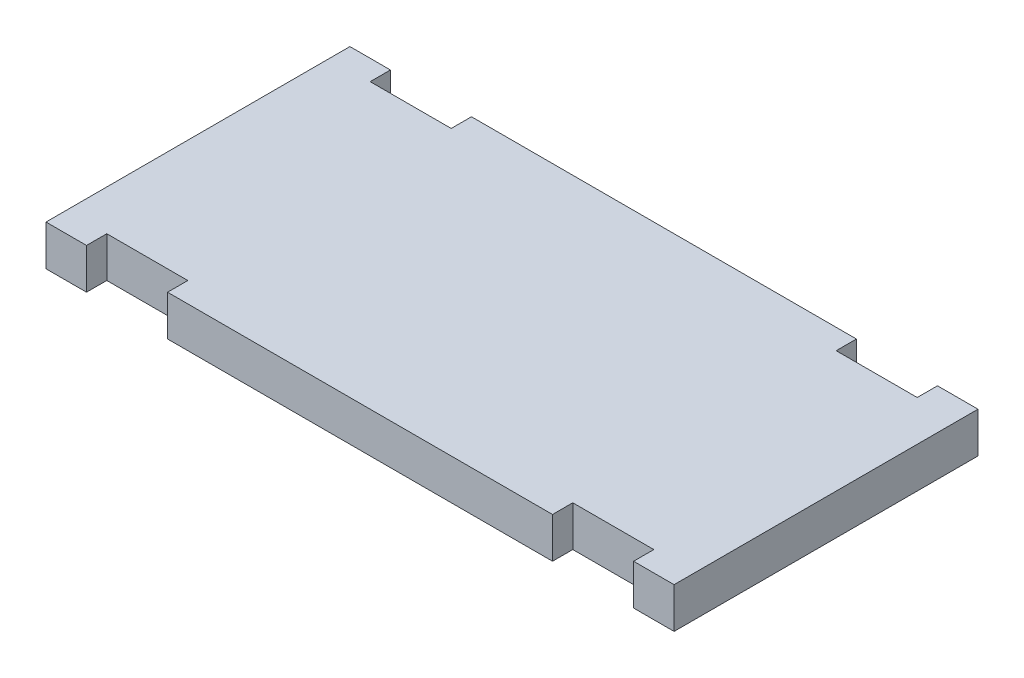
ISO-10303-21;
HEADER;
FILE_DESCRIPTION(('STEP AP214'),'2;1');
FILE_NAME('part.step','',(''),(''),'','','');
FILE_SCHEMA(('AUTOMOTIVE_DESIGN { 1 0 10303 214 1 1 1 1 }'));
ENDSEC;
DATA;
#1=APPLICATION_CONTEXT('core data for automotive mechanical design processes');
#2=APPLICATION_PROTOCOL_DEFINITION('international standard','automotive_design',2000,#1);
#3=PRODUCT_CONTEXT('',#1,'mechanical');
#4=PRODUCT('Part','Part','',(#3));
#5=PRODUCT_RELATED_PRODUCT_CATEGORY('part','',(#4));
#6=PRODUCT_DEFINITION_FORMATION('','',#4);
#7=PRODUCT_DEFINITION_CONTEXT('part definition',#1,'design');
#8=PRODUCT_DEFINITION('design','',#6,#7);
#9=PRODUCT_DEFINITION_SHAPE('','',#8);
#10=(LENGTH_UNIT() NAMED_UNIT(*) SI_UNIT(.MILLI.,.METRE.));
#11=(NAMED_UNIT(*) PLANE_ANGLE_UNIT() SI_UNIT($,.RADIAN.));
#12=(NAMED_UNIT(*) SI_UNIT($,.STERADIAN.) SOLID_ANGLE_UNIT());
#13=UNCERTAINTY_MEASURE_WITH_UNIT(LENGTH_MEASURE(1.E-05),#10,'distance_accuracy_value','');
#14=(GEOMETRIC_REPRESENTATION_CONTEXT(3) GLOBAL_UNCERTAINTY_ASSIGNED_CONTEXT((#13)) GLOBAL_UNIT_ASSIGNED_CONTEXT((#10,
#11,#12)) REPRESENTATION_CONTEXT('',''));
#15=CARTESIAN_POINT('',(0.,0.,0.));
#16=DIRECTION('',(0.,0.,1.));
#17=DIRECTION('',(1.,0.,0.));
#18=AXIS2_PLACEMENT_3D('',#15,#16,#17);
#19=CARTESIAN_POINT('',(-7.75,1.,-3.75));
#20=DIRECTION('',(1.,0.,0.));
#21=DIRECTION('',(0.,0.,-1.));
#22=AXIS2_PLACEMENT_3D('',#19,#20,#21);
#23=PLANE('',#22);
#24=DIRECTION('',(0.,0.,1.));
#25=VECTOR('',#24,1.);
#26=CARTESIAN_POINT('',(-7.75,0.,-3.75));
#27=LINE('',#26,#25);
#28=CARTESIAN_POINT('',(-7.75,0.,-3.75));
#29=VERTEX_POINT('',#28);
#30=CARTESIAN_POINT('',(-7.75,0.,3.75));
#31=VERTEX_POINT('',#30);
#32=EDGE_CURVE('E201',#29,#31,#27,.T.);
#33=ORIENTED_EDGE('',*,*,#32,.T.);
#34=DIRECTION('',(0.,-1.,0.));
#35=VECTOR('',#34,1.);
#36=CARTESIAN_POINT('',(-7.75,1.,3.75));
#37=LINE('',#36,#35);
#38=CARTESIAN_POINT('',(-7.75,1.,3.75));
#39=VERTEX_POINT('',#38);
#40=EDGE_CURVE('E11',#39,#31,#37,.T.);
#41=ORIENTED_EDGE('',*,*,#40,.F.);
#42=DIRECTION('',(0.,0.,1.));
#43=VECTOR('',#42,1.);
#44=CARTESIAN_POINT('',(-7.75,1.,-3.75));
#45=LINE('',#44,#43);
#46=CARTESIAN_POINT('',(-7.75,1.,-3.75));
#47=VERTEX_POINT('',#46);
#48=EDGE_CURVE('E239',#47,#39,#45,.T.);
#49=ORIENTED_EDGE('',*,*,#48,.F.);
#50=DIRECTION('',(0.,-1.,0.));
#51=VECTOR('',#50,1.);
#52=CARTESIAN_POINT('',(-7.75,1.,-3.75));
#53=LINE('',#52,#51);
#54=EDGE_CURVE('E197',#47,#29,#53,.T.);
#55=ORIENTED_EDGE('',*,*,#54,.T.);
#56=EDGE_LOOP('',(#33,#41,#49,#55));
#57=FACE_BOUND('',#56,.T.);
#58=ADVANCED_FACE('F33',(#57),#23,.F.);
#59=CARTESIAN_POINT('',(-7.75,1.,3.75));
#60=DIRECTION('',(0.,0.,-1.));
#61=DIRECTION('',(-1.,0.,0.));
#62=AXIS2_PLACEMENT_3D('',#59,#60,#61);
#63=PLANE('',#62);
#64=DIRECTION('',(1.,0.,0.));
#65=VECTOR('',#64,1.);
#66=CARTESIAN_POINT('',(-7.75,0.,3.75));
#67=LINE('',#66,#65);
#68=CARTESIAN_POINT('',(-6.75,0.,3.75));
#69=VERTEX_POINT('',#68);
#70=EDGE_CURVE('E204',#31,#69,#67,.T.);
#71=ORIENTED_EDGE('',*,*,#70,.T.);
#72=DIRECTION('',(0.,-1.,0.));
#73=VECTOR('',#72,1.);
#74=CARTESIAN_POINT('',(-6.75,1.,3.75));
#75=LINE('',#74,#73);
#76=CARTESIAN_POINT('',(-6.75,1.,3.75));
#77=VERTEX_POINT('',#76);
#78=EDGE_CURVE('E41',#77,#69,#75,.T.);
#79=ORIENTED_EDGE('',*,*,#78,.F.);
#80=DIRECTION('',(1.,0.,0.));
#81=VECTOR('',#80,1.);
#82=CARTESIAN_POINT('',(-7.75,1.,3.75));
#83=LINE('',#82,#81);
#84=EDGE_CURVE('E128',#39,#77,#83,.T.);
#85=ORIENTED_EDGE('',*,*,#84,.F.);
#86=ORIENTED_EDGE('',*,*,#40,.T.);
#87=EDGE_LOOP('',(#71,#79,#85,#86));
#88=FACE_BOUND('',#87,.T.);
#89=ADVANCED_FACE('F357',(#88),#63,.F.);
#90=CARTESIAN_POINT('',(-6.75,1.,3.75));
#91=DIRECTION('',(-1.,0.,0.));
#92=DIRECTION('',(0.,0.,1.));
#93=AXIS2_PLACEMENT_3D('',#90,#91,#92);
#94=PLANE('',#93);
#95=DIRECTION('',(0.,0.,-1.));
#96=VECTOR('',#95,1.);
#97=CARTESIAN_POINT('',(-6.75,0.,3.75));
#98=LINE('',#97,#96);
#99=CARTESIAN_POINT('',(-6.75,0.,3.25));
#100=VERTEX_POINT('',#99);
#101=EDGE_CURVE('E206',#69,#100,#98,.T.);
#102=ORIENTED_EDGE('',*,*,#101,.T.);
#103=DIRECTION('',(0.,-1.,0.));
#104=VECTOR('',#103,1.);
#105=CARTESIAN_POINT('',(-6.75,1.,3.25));
#106=LINE('',#105,#104);
#107=CARTESIAN_POINT('',(-6.75,1.,3.25));
#108=VERTEX_POINT('',#107);
#109=EDGE_CURVE('E282',#108,#100,#106,.T.);
#110=ORIENTED_EDGE('',*,*,#109,.F.);
#111=DIRECTION('',(0.,0.,-1.));
#112=VECTOR('',#111,1.);
#113=CARTESIAN_POINT('',(-6.75,1.,3.75));
#114=LINE('',#113,#112);
#115=EDGE_CURVE('E290',#77,#108,#114,.T.);
#116=ORIENTED_EDGE('',*,*,#115,.F.);
#117=ORIENTED_EDGE('',*,*,#78,.T.);
#118=EDGE_LOOP('',(#102,#110,#116,#117));
#119=FACE_BOUND('',#118,.T.);
#120=ADVANCED_FACE('F288',(#119),#94,.F.);
#121=CARTESIAN_POINT('',(-6.75,1.,3.25));
#122=DIRECTION('',(0.,0.,-1.));
#123=DIRECTION('',(-1.,0.,0.));
#124=AXIS2_PLACEMENT_3D('',#121,#122,#123);
#125=PLANE('',#124);
#126=DIRECTION('',(1.,0.,0.));
#127=VECTOR('',#126,1.);
#128=CARTESIAN_POINT('',(-6.75,0.,3.25));
#129=LINE('',#128,#127);
#130=CARTESIAN_POINT('',(-4.75,0.,3.25));
#131=VERTEX_POINT('',#130);
#132=EDGE_CURVE('E208',#100,#131,#129,.T.);
#133=ORIENTED_EDGE('',*,*,#132,.T.);
#134=DIRECTION('',(0.,-1.,0.));
#135=VECTOR('',#134,1.);
#136=CARTESIAN_POINT('',(-4.75,1.,3.25));
#137=LINE('',#136,#135);
#138=CARTESIAN_POINT('',(-4.75,1.,3.25));
#139=VERTEX_POINT('',#138);
#140=EDGE_CURVE('E279',#139,#131,#137,.T.);
#141=ORIENTED_EDGE('',*,*,#140,.F.);
#142=DIRECTION('',(1.,0.,0.));
#143=VECTOR('',#142,1.);
#144=CARTESIAN_POINT('',(-6.75,1.,3.25));
#145=LINE('',#144,#143);
#146=EDGE_CURVE('E308',#108,#139,#145,.T.);
#147=ORIENTED_EDGE('',*,*,#146,.F.);
#148=ORIENTED_EDGE('',*,*,#109,.T.);
#149=EDGE_LOOP('',(#133,#141,#147,#148));
#150=FACE_BOUND('',#149,.T.);
#151=ADVANCED_FACE('F299',(#150),#125,.F.);
#152=CARTESIAN_POINT('',(-4.75,1.,3.75));
#153=DIRECTION('',(1.,0.,0.));
#154=DIRECTION('',(0.,0.,-1.));
#155=AXIS2_PLACEMENT_3D('',#152,#153,#154);
#156=PLANE('',#155);
#157=DIRECTION('',(0.,0.,1.));
#158=VECTOR('',#157,1.);
#159=CARTESIAN_POINT('',(-4.75,0.,3.75));
#160=LINE('',#159,#158);
#161=CARTESIAN_POINT('',(-4.75,0.,3.75));
#162=VERTEX_POINT('',#161);
#163=EDGE_CURVE('E210',#131,#162,#160,.T.);
#164=ORIENTED_EDGE('',*,*,#163,.T.);
#165=DIRECTION('',(0.,-1.,0.));
#166=VECTOR('',#165,1.);
#167=CARTESIAN_POINT('',(-4.75,1.,3.75));
#168=LINE('',#167,#166);
#169=CARTESIAN_POINT('',(-4.75,1.,3.75));
#170=VERTEX_POINT('',#169);
#171=EDGE_CURVE('E276',#170,#162,#168,.T.);
#172=ORIENTED_EDGE('',*,*,#171,.F.);
#173=DIRECTION('',(0.,0.,1.));
#174=VECTOR('',#173,1.);
#175=CARTESIAN_POINT('',(-4.75,1.,3.75));
#176=LINE('',#175,#174);
#177=EDGE_CURVE('E305',#139,#170,#176,.T.);
#178=ORIENTED_EDGE('',*,*,#177,.F.);
#179=ORIENTED_EDGE('',*,*,#140,.T.);
#180=EDGE_LOOP('',(#164,#172,#178,#179));
#181=FACE_BOUND('',#180,.T.);
#182=ADVANCED_FACE('F303',(#181),#156,.F.);
#183=CARTESIAN_POINT('',(-4.75,1.,3.75));
#184=DIRECTION('',(0.,0.,-1.));
#185=DIRECTION('',(-1.,0.,0.));
#186=AXIS2_PLACEMENT_3D('',#183,#184,#185);
#187=PLANE('',#186);
#188=DIRECTION('',(1.,0.,0.));
#189=VECTOR('',#188,1.);
#190=CARTESIAN_POINT('',(-4.75,0.,3.75));
#191=LINE('',#190,#189);
#192=CARTESIAN_POINT('',(4.75,0.,3.75));
#193=VERTEX_POINT('',#192);
#194=EDGE_CURVE('E212',#162,#193,#191,.T.);
#195=ORIENTED_EDGE('',*,*,#194,.T.);
#196=DIRECTION('',(0.,-1.,0.));
#197=VECTOR('',#196,1.);
#198=CARTESIAN_POINT('',(4.75,1.,3.75));
#199=LINE('',#198,#197);
#200=CARTESIAN_POINT('',(4.75,1.,3.75));
#201=VERTEX_POINT('',#200);
#202=EDGE_CURVE('E273',#201,#193,#199,.T.);
#203=ORIENTED_EDGE('',*,*,#202,.F.);
#204=DIRECTION('',(1.,0.,0.));
#205=VECTOR('',#204,1.);
#206=CARTESIAN_POINT('',(-4.75,1.,3.75));
#207=LINE('',#206,#205);
#208=EDGE_CURVE('E307',#170,#201,#207,.T.);
#209=ORIENTED_EDGE('',*,*,#208,.F.);
#210=ORIENTED_EDGE('',*,*,#171,.T.);
#211=EDGE_LOOP('',(#195,#203,#209,#210));
#212=FACE_BOUND('',#211,.T.);
#213=ADVANCED_FACE('F370',(#212),#187,.F.);
#214=CARTESIAN_POINT('',(4.75,1.,3.75));
#215=DIRECTION('',(-1.,0.,0.));
#216=DIRECTION('',(0.,0.,1.));
#217=AXIS2_PLACEMENT_3D('',#214,#215,#216);
#218=PLANE('',#217);
#219=DIRECTION('',(0.,0.,-1.));
#220=VECTOR('',#219,1.);
#221=CARTESIAN_POINT('',(4.75,0.,3.75));
#222=LINE('',#221,#220);
#223=CARTESIAN_POINT('',(4.75,0.,3.25));
#224=VERTEX_POINT('',#223);
#225=EDGE_CURVE('E214',#193,#224,#222,.T.);
#226=ORIENTED_EDGE('',*,*,#225,.T.);
#227=DIRECTION('',(0.,-1.,0.));
#228=VECTOR('',#227,1.);
#229=CARTESIAN_POINT('',(4.75,1.,3.25));
#230=LINE('',#229,#228);
#231=CARTESIAN_POINT('',(4.75,1.,3.25));
#232=VERTEX_POINT('',#231);
#233=EDGE_CURVE('E270',#232,#224,#230,.T.);
#234=ORIENTED_EDGE('',*,*,#233,.F.);
#235=DIRECTION('',(0.,0.,-1.));
#236=VECTOR('',#235,1.);
#237=CARTESIAN_POINT('',(4.75,1.,3.75));
#238=LINE('',#237,#236);
#239=EDGE_CURVE('E310',#201,#232,#238,.T.);
#240=ORIENTED_EDGE('',*,*,#239,.F.);
#241=ORIENTED_EDGE('',*,*,#202,.T.);
#242=EDGE_LOOP('',(#226,#234,#240,#241));
#243=FACE_BOUND('',#242,.T.);
#244=ADVANCED_FACE('F373',(#243),#218,.F.);
#245=CARTESIAN_POINT('',(6.75,1.,3.25));
#246=DIRECTION('',(0.,0.,-1.));
#247=DIRECTION('',(-1.,0.,0.));
#248=AXIS2_PLACEMENT_3D('',#245,#246,#247);
#249=PLANE('',#248);
#250=DIRECTION('',(1.,0.,0.));
#251=VECTOR('',#250,1.);
#252=CARTESIAN_POINT('',(6.75,0.,3.25));
#253=LINE('',#252,#251);
#254=CARTESIAN_POINT('',(6.75,0.,3.25));
#255=VERTEX_POINT('',#254);
#256=EDGE_CURVE('E216',#224,#255,#253,.T.);
#257=ORIENTED_EDGE('',*,*,#256,.T.);
#258=DIRECTION('',(0.,-1.,0.));
#259=VECTOR('',#258,1.);
#260=CARTESIAN_POINT('',(6.75,1.,3.25));
#261=LINE('',#260,#259);
#262=CARTESIAN_POINT('',(6.75,1.,3.25));
#263=VERTEX_POINT('',#262);
#264=EDGE_CURVE('E267',#263,#255,#261,.T.);
#265=ORIENTED_EDGE('',*,*,#264,.F.);
#266=DIRECTION('',(1.,0.,0.));
#267=VECTOR('',#266,1.);
#268=CARTESIAN_POINT('',(6.75,1.,3.25));
#269=LINE('',#268,#267);
#270=EDGE_CURVE('E316',#232,#263,#269,.T.);
#271=ORIENTED_EDGE('',*,*,#270,.F.);
#272=ORIENTED_EDGE('',*,*,#233,.T.);
#273=EDGE_LOOP('',(#257,#265,#271,#272));
#274=FACE_BOUND('',#273,.T.);
#275=ADVANCED_FACE('F377',(#274),#249,.F.);
#276=CARTESIAN_POINT('',(6.75,1.,3.75));
#277=DIRECTION('',(1.,0.,0.));
#278=DIRECTION('',(0.,0.,-1.));
#279=AXIS2_PLACEMENT_3D('',#276,#277,#278);
#280=PLANE('',#279);
#281=DIRECTION('',(0.,0.,1.));
#282=VECTOR('',#281,1.);
#283=CARTESIAN_POINT('',(6.75,0.,3.75));
#284=LINE('',#283,#282);
#285=CARTESIAN_POINT('',(6.75,0.,3.75));
#286=VERTEX_POINT('',#285);
#287=EDGE_CURVE('E218',#255,#286,#284,.T.);
#288=ORIENTED_EDGE('',*,*,#287,.T.);
#289=DIRECTION('',(0.,-1.,0.));
#290=VECTOR('',#289,1.);
#291=CARTESIAN_POINT('',(6.75,1.,3.75));
#292=LINE('',#291,#290);
#293=CARTESIAN_POINT('',(6.75,1.,3.75));
#294=VERTEX_POINT('',#293);
#295=EDGE_CURVE('E264',#294,#286,#292,.T.);
#296=ORIENTED_EDGE('',*,*,#295,.F.);
#297=DIRECTION('',(0.,0.,1.));
#298=VECTOR('',#297,1.);
#299=CARTESIAN_POINT('',(6.75,1.,3.75));
#300=LINE('',#299,#298);
#301=EDGE_CURVE('E318',#263,#294,#300,.T.);
#302=ORIENTED_EDGE('',*,*,#301,.F.);
#303=ORIENTED_EDGE('',*,*,#264,.T.);
#304=EDGE_LOOP('',(#288,#296,#302,#303));
#305=FACE_BOUND('',#304,.T.);
#306=ADVANCED_FACE('F381',(#305),#280,.F.);
#307=CARTESIAN_POINT('',(6.75,1.,3.75));
#308=DIRECTION('',(0.,0.,-1.));
#309=DIRECTION('',(-1.,0.,0.));
#310=AXIS2_PLACEMENT_3D('',#307,#308,#309);
#311=PLANE('',#310);
#312=DIRECTION('',(1.,0.,0.));
#313=VECTOR('',#312,1.);
#314=CARTESIAN_POINT('',(6.75,0.,3.75));
#315=LINE('',#314,#313);
#316=CARTESIAN_POINT('',(7.75,0.,3.75));
#317=VERTEX_POINT('',#316);
#318=EDGE_CURVE('E220',#286,#317,#315,.T.);
#319=ORIENTED_EDGE('',*,*,#318,.T.);
#320=DIRECTION('',(0.,-1.,0.));
#321=VECTOR('',#320,1.);
#322=CARTESIAN_POINT('',(7.75,1.,3.75));
#323=LINE('',#322,#321);
#324=CARTESIAN_POINT('',(7.75,1.,3.75));
#325=VERTEX_POINT('',#324);
#326=EDGE_CURVE('E261',#325,#317,#323,.T.);
#327=ORIENTED_EDGE('',*,*,#326,.F.);
#328=DIRECTION('',(1.,0.,0.));
#329=VECTOR('',#328,1.);
#330=CARTESIAN_POINT('',(6.75,1.,3.75));
#331=LINE('',#330,#329);
#332=EDGE_CURVE('E320',#294,#325,#331,.T.);
#333=ORIENTED_EDGE('',*,*,#332,.F.);
#334=ORIENTED_EDGE('',*,*,#295,.T.);
#335=EDGE_LOOP('',(#319,#327,#333,#334));
#336=FACE_BOUND('',#335,.T.);
#337=ADVANCED_FACE('F385',(#336),#311,.F.);
#338=CARTESIAN_POINT('',(7.75,1.,-3.75));
#339=DIRECTION('',(-1.,0.,0.));
#340=DIRECTION('',(0.,0.,1.));
#341=AXIS2_PLACEMENT_3D('',#338,#339,#340);
#342=PLANE('',#341);
#343=DIRECTION('',(0.,0.,-1.));
#344=VECTOR('',#343,1.);
#345=CARTESIAN_POINT('',(7.75,0.,-3.75));
#346=LINE('',#345,#344);
#347=CARTESIAN_POINT('',(7.75,0.,-3.75));
#348=VERTEX_POINT('',#347);
#349=EDGE_CURVE('E222',#317,#348,#346,.T.);
#350=ORIENTED_EDGE('',*,*,#349,.T.);
#351=DIRECTION('',(0.,-1.,0.));
#352=VECTOR('',#351,1.);
#353=CARTESIAN_POINT('',(7.75,1.,-3.75));
#354=LINE('',#353,#352);
#355=CARTESIAN_POINT('',(7.75,1.,-3.75));
#356=VERTEX_POINT('',#355);
#357=EDGE_CURVE('E258',#356,#348,#354,.T.);
#358=ORIENTED_EDGE('',*,*,#357,.F.);
#359=DIRECTION('',(0.,0.,-1.));
#360=VECTOR('',#359,1.);
#361=CARTESIAN_POINT('',(7.75,1.,-3.75));
#362=LINE('',#361,#360);
#363=EDGE_CURVE('E322',#325,#356,#362,.T.);
#364=ORIENTED_EDGE('',*,*,#363,.F.);
#365=ORIENTED_EDGE('',*,*,#326,.T.);
#366=EDGE_LOOP('',(#350,#358,#364,#365));
#367=FACE_BOUND('',#366,.T.);
#368=ADVANCED_FACE('F389',(#367),#342,.F.);
#369=CARTESIAN_POINT('',(6.75,1.,-3.75));
#370=DIRECTION('',(0.,0.,1.));
#371=DIRECTION('',(1.,0.,0.));
#372=AXIS2_PLACEMENT_3D('',#369,#370,#371);
#373=PLANE('',#372);
#374=DIRECTION('',(-1.,0.,0.));
#375=VECTOR('',#374,1.);
#376=CARTESIAN_POINT('',(6.75,0.,-3.75));
#377=LINE('',#376,#375);
#378=CARTESIAN_POINT('',(6.75,0.,-3.75));
#379=VERTEX_POINT('',#378);
#380=EDGE_CURVE('E224',#348,#379,#377,.T.);
#381=ORIENTED_EDGE('',*,*,#380,.T.);
#382=DIRECTION('',(0.,-1.,0.));
#383=VECTOR('',#382,1.);
#384=CARTESIAN_POINT('',(6.75,1.,-3.75));
#385=LINE('',#384,#383);
#386=CARTESIAN_POINT('',(6.75,1.,-3.75));
#387=VERTEX_POINT('',#386);
#388=EDGE_CURVE('E255',#387,#379,#385,.T.);
#389=ORIENTED_EDGE('',*,*,#388,.F.);
#390=DIRECTION('',(-1.,0.,0.));
#391=VECTOR('',#390,1.);
#392=CARTESIAN_POINT('',(6.75,1.,-3.75));
#393=LINE('',#392,#391);
#394=EDGE_CURVE('E324',#356,#387,#393,.T.);
#395=ORIENTED_EDGE('',*,*,#394,.F.);
#396=ORIENTED_EDGE('',*,*,#357,.T.);
#397=EDGE_LOOP('',(#381,#389,#395,#396));
#398=FACE_BOUND('',#397,.T.);
#399=ADVANCED_FACE('F393',(#398),#373,.F.);
#400=CARTESIAN_POINT('',(6.75,1.,-3.75));
#401=DIRECTION('',(1.,0.,0.));
#402=DIRECTION('',(0.,0.,-1.));
#403=AXIS2_PLACEMENT_3D('',#400,#401,#402);
#404=PLANE('',#403);
#405=DIRECTION('',(0.,0.,1.));
#406=VECTOR('',#405,1.);
#407=CARTESIAN_POINT('',(6.75,0.,-3.75));
#408=LINE('',#407,#406);
#409=CARTESIAN_POINT('',(6.75,0.,-3.25));
#410=VERTEX_POINT('',#409);
#411=EDGE_CURVE('E226',#379,#410,#408,.T.);
#412=ORIENTED_EDGE('',*,*,#411,.T.);
#413=DIRECTION('',(0.,-1.,0.));
#414=VECTOR('',#413,1.);
#415=CARTESIAN_POINT('',(6.75,1.,-3.25));
#416=LINE('',#415,#414);
#417=CARTESIAN_POINT('',(6.75,1.,-3.25));
#418=VERTEX_POINT('',#417);
#419=EDGE_CURVE('E252',#418,#410,#416,.T.);
#420=ORIENTED_EDGE('',*,*,#419,.F.);
#421=DIRECTION('',(0.,0.,1.));
#422=VECTOR('',#421,1.);
#423=CARTESIAN_POINT('',(6.75,1.,-3.75));
#424=LINE('',#423,#422);
#425=EDGE_CURVE('E326',#387,#418,#424,.T.);
#426=ORIENTED_EDGE('',*,*,#425,.F.);
#427=ORIENTED_EDGE('',*,*,#388,.T.);
#428=EDGE_LOOP('',(#412,#420,#426,#427));
#429=FACE_BOUND('',#428,.T.);
#430=ADVANCED_FACE('F397',(#429),#404,.F.);
#431=CARTESIAN_POINT('',(6.75,1.,-3.25));
#432=DIRECTION('',(0.,0.,1.));
#433=DIRECTION('',(1.,0.,0.));
#434=AXIS2_PLACEMENT_3D('',#431,#432,#433);
#435=PLANE('',#434);
#436=DIRECTION('',(-1.,0.,0.));
#437=VECTOR('',#436,1.);
#438=CARTESIAN_POINT('',(6.75,0.,-3.25));
#439=LINE('',#438,#437);
#440=CARTESIAN_POINT('',(4.75,0.,-3.25));
#441=VERTEX_POINT('',#440);
#442=EDGE_CURVE('E228',#410,#441,#439,.T.);
#443=ORIENTED_EDGE('',*,*,#442,.T.);
#444=DIRECTION('',(0.,-1.,0.));
#445=VECTOR('',#444,1.);
#446=CARTESIAN_POINT('',(4.75,1.,-3.25));
#447=LINE('',#446,#445);
#448=CARTESIAN_POINT('',(4.75,1.,-3.25));
#449=VERTEX_POINT('',#448);
#450=EDGE_CURVE('E249',#449,#441,#447,.T.);
#451=ORIENTED_EDGE('',*,*,#450,.F.);
#452=DIRECTION('',(-1.,0.,0.));
#453=VECTOR('',#452,1.);
#454=CARTESIAN_POINT('',(6.75,1.,-3.25));
#455=LINE('',#454,#453);
#456=EDGE_CURVE('E328',#418,#449,#455,.T.);
#457=ORIENTED_EDGE('',*,*,#456,.F.);
#458=ORIENTED_EDGE('',*,*,#419,.T.);
#459=EDGE_LOOP('',(#443,#451,#457,#458));
#460=FACE_BOUND('',#459,.T.);
#461=ADVANCED_FACE('F401',(#460),#435,.F.);
#462=CARTESIAN_POINT('',(4.75,1.,-3.75));
#463=DIRECTION('',(-1.,0.,0.));
#464=DIRECTION('',(0.,0.,1.));
#465=AXIS2_PLACEMENT_3D('',#462,#463,#464);
#466=PLANE('',#465);
#467=DIRECTION('',(0.,0.,-1.));
#468=VECTOR('',#467,1.);
#469=CARTESIAN_POINT('',(4.75,0.,-3.75));
#470=LINE('',#469,#468);
#471=CARTESIAN_POINT('',(4.75,0.,-3.75));
#472=VERTEX_POINT('',#471);
#473=EDGE_CURVE('E230',#441,#472,#470,.T.);
#474=ORIENTED_EDGE('',*,*,#473,.T.);
#475=DIRECTION('',(0.,-1.,0.));
#476=VECTOR('',#475,1.);
#477=CARTESIAN_POINT('',(4.75,1.,-3.75));
#478=LINE('',#477,#476);
#479=CARTESIAN_POINT('',(4.75,1.,-3.75));
#480=VERTEX_POINT('',#479);
#481=EDGE_CURVE('E246',#480,#472,#478,.T.);
#482=ORIENTED_EDGE('',*,*,#481,.F.);
#483=DIRECTION('',(0.,0.,-1.));
#484=VECTOR('',#483,1.);
#485=CARTESIAN_POINT('',(4.75,1.,-3.75));
#486=LINE('',#485,#484);
#487=EDGE_CURVE('E330',#449,#480,#486,.T.);
#488=ORIENTED_EDGE('',*,*,#487,.F.);
#489=ORIENTED_EDGE('',*,*,#450,.T.);
#490=EDGE_LOOP('',(#474,#482,#488,#489));
#491=FACE_BOUND('',#490,.T.);
#492=ADVANCED_FACE('F405',(#491),#466,.F.);
#493=CARTESIAN_POINT('',(-4.75,1.,-3.75));
#494=DIRECTION('',(0.,0.,1.));
#495=DIRECTION('',(1.,0.,0.));
#496=AXIS2_PLACEMENT_3D('',#493,#494,#495);
#497=PLANE('',#496);
#498=DIRECTION('',(-1.,0.,0.));
#499=VECTOR('',#498,1.);
#500=CARTESIAN_POINT('',(-4.75,0.,-3.75));
#501=LINE('',#500,#499);
#502=CARTESIAN_POINT('',(-4.75,0.,-3.75));
#503=VERTEX_POINT('',#502);
#504=EDGE_CURVE('E232',#472,#503,#501,.T.);
#505=ORIENTED_EDGE('',*,*,#504,.T.);
#506=DIRECTION('',(0.,-1.,0.));
#507=VECTOR('',#506,1.);
#508=CARTESIAN_POINT('',(-4.75,1.,-3.75));
#509=LINE('',#508,#507);
#510=CARTESIAN_POINT('',(-4.75,1.,-3.75));
#511=VERTEX_POINT('',#510);
#512=EDGE_CURVE('E243',#511,#503,#509,.T.);
#513=ORIENTED_EDGE('',*,*,#512,.F.);
#514=DIRECTION('',(-1.,0.,0.));
#515=VECTOR('',#514,1.);
#516=CARTESIAN_POINT('',(-4.75,1.,-3.75));
#517=LINE('',#516,#515);
#518=EDGE_CURVE('E332',#480,#511,#517,.T.);
#519=ORIENTED_EDGE('',*,*,#518,.F.);
#520=ORIENTED_EDGE('',*,*,#481,.T.);
#521=EDGE_LOOP('',(#505,#513,#519,#520));
#522=FACE_BOUND('',#521,.T.);
#523=ADVANCED_FACE('F338',(#522),#497,.F.);
#524=CARTESIAN_POINT('',(-4.75,1.,-3.75));
#525=DIRECTION('',(1.,0.,0.));
#526=DIRECTION('',(0.,0.,-1.));
#527=AXIS2_PLACEMENT_3D('',#524,#525,#526);
#528=PLANE('',#527);
#529=DIRECTION('',(0.,0.,1.));
#530=VECTOR('',#529,1.);
#531=CARTESIAN_POINT('',(-4.75,0.,-3.75));
#532=LINE('',#531,#530);
#533=CARTESIAN_POINT('',(-4.75,0.,-3.25));
#534=VERTEX_POINT('',#533);
#535=EDGE_CURVE('E234',#503,#534,#532,.T.);
#536=ORIENTED_EDGE('',*,*,#535,.T.);
#537=DIRECTION('',(0.,-1.,0.));
#538=VECTOR('',#537,1.);
#539=CARTESIAN_POINT('',(-4.75,1.,-3.25));
#540=LINE('',#539,#538);
#541=CARTESIAN_POINT('',(-4.75,1.,-3.25));
#542=VERTEX_POINT('',#541);
#543=EDGE_CURVE('E192',#542,#534,#540,.T.);
#544=ORIENTED_EDGE('',*,*,#543,.F.);
#545=DIRECTION('',(0.,0.,1.));
#546=VECTOR('',#545,1.);
#547=CARTESIAN_POINT('',(-4.75,1.,-3.75));
#548=LINE('',#547,#546);
#549=EDGE_CURVE('E183',#511,#542,#548,.T.);
#550=ORIENTED_EDGE('',*,*,#549,.F.);
#551=ORIENTED_EDGE('',*,*,#512,.T.);
#552=EDGE_LOOP('',(#536,#544,#550,#551));
#553=FACE_BOUND('',#552,.T.);
#554=ADVANCED_FACE('F342',(#553),#528,.F.);
#555=CARTESIAN_POINT('',(-6.75,1.,-3.25));
#556=DIRECTION('',(0.,0.,1.));
#557=DIRECTION('',(1.,0.,0.));
#558=AXIS2_PLACEMENT_3D('',#555,#556,#557);
#559=PLANE('',#558);
#560=DIRECTION('',(-1.,0.,0.));
#561=VECTOR('',#560,1.);
#562=CARTESIAN_POINT('',(-6.75,0.,-3.25));
#563=LINE('',#562,#561);
#564=CARTESIAN_POINT('',(-6.75,0.,-3.25));
#565=VERTEX_POINT('',#564);
#566=EDGE_CURVE('E191',#534,#565,#563,.T.);
#567=ORIENTED_EDGE('',*,*,#566,.T.);
#568=DIRECTION('',(0.,-1.,0.));
#569=VECTOR('',#568,1.);
#570=CARTESIAN_POINT('',(-6.75,1.,-3.25));
#571=LINE('',#570,#569);
#572=CARTESIAN_POINT('',(-6.75,1.,-3.25));
#573=VERTEX_POINT('',#572);
#574=EDGE_CURVE('E188',#573,#565,#571,.T.);
#575=ORIENTED_EDGE('',*,*,#574,.F.);
#576=DIRECTION('',(-1.,0.,0.));
#577=VECTOR('',#576,1.);
#578=CARTESIAN_POINT('',(-6.75,1.,-3.25));
#579=LINE('',#578,#577);
#580=EDGE_CURVE('E177',#542,#573,#579,.T.);
#581=ORIENTED_EDGE('',*,*,#580,.F.);
#582=ORIENTED_EDGE('',*,*,#543,.T.);
#583=EDGE_LOOP('',(#567,#575,#581,#582));
#584=FACE_BOUND('',#583,.T.);
#585=ADVANCED_FACE('F189',(#584),#559,.F.);
#586=CARTESIAN_POINT('',(-6.75,1.,-3.75));
#587=DIRECTION('',(-1.,0.,0.));
#588=DIRECTION('',(0.,0.,1.));
#589=AXIS2_PLACEMENT_3D('',#586,#587,#588);
#590=PLANE('',#589);
#591=DIRECTION('',(0.,0.,-1.));
#592=VECTOR('',#591,1.);
#593=CARTESIAN_POINT('',(-6.75,0.,-3.75));
#594=LINE('',#593,#592);
#595=CARTESIAN_POINT('',(-6.75,0.,-3.75));
#596=VERTEX_POINT('',#595);
#597=EDGE_CURVE('E114',#565,#596,#594,.T.);
#598=ORIENTED_EDGE('',*,*,#597,.T.);
#599=DIRECTION('',(0.,-1.,0.));
#600=VECTOR('',#599,1.);
#601=CARTESIAN_POINT('',(-6.75,1.,-3.75));
#602=LINE('',#601,#600);
#603=CARTESIAN_POINT('',(-6.75,1.,-3.75));
#604=VERTEX_POINT('',#603);
#605=EDGE_CURVE('E193',#604,#596,#602,.T.);
#606=ORIENTED_EDGE('',*,*,#605,.F.);
#607=DIRECTION('',(0.,0.,-1.));
#608=VECTOR('',#607,1.);
#609=CARTESIAN_POINT('',(-6.75,1.,-3.75));
#610=LINE('',#609,#608);
#611=EDGE_CURVE('E181',#573,#604,#610,.T.);
#612=ORIENTED_EDGE('',*,*,#611,.F.);
#613=ORIENTED_EDGE('',*,*,#574,.T.);
#614=EDGE_LOOP('',(#598,#606,#612,#613));
#615=FACE_BOUND('',#614,.T.);
#616=ADVANCED_FACE('F195',(#615),#590,.F.);
#617=CARTESIAN_POINT('',(-7.75,1.,-3.75));
#618=DIRECTION('',(0.,0.,1.));
#619=DIRECTION('',(1.,0.,0.));
#620=AXIS2_PLACEMENT_3D('',#617,#618,#619);
#621=PLANE('',#620);
#622=DIRECTION('',(-1.,0.,0.));
#623=VECTOR('',#622,1.);
#624=CARTESIAN_POINT('',(-7.75,0.,-3.75));
#625=LINE('',#624,#623);
#626=EDGE_CURVE('E120',#596,#29,#625,.T.);
#627=ORIENTED_EDGE('',*,*,#626,.T.);
#628=ORIENTED_EDGE('',*,*,#54,.F.);
#629=DIRECTION('',(-1.,0.,0.));
#630=VECTOR('',#629,1.);
#631=CARTESIAN_POINT('',(-7.75,1.,-3.75));
#632=LINE('',#631,#630);
#633=EDGE_CURVE('E49',#604,#47,#632,.T.);
#634=ORIENTED_EDGE('',*,*,#633,.F.);
#635=ORIENTED_EDGE('',*,*,#605,.T.);
#636=EDGE_LOOP('',(#627,#628,#634,#635));
#637=FACE_BOUND('',#636,.T.);
#638=ADVANCED_FACE('F346',(#637),#621,.F.);
#639=CARTESIAN_POINT('',(0.,1.,0.));
#640=DIRECTION('',(0.,1.,0.));
#641=DIRECTION('',(0.,0.,1.));
#642=AXIS2_PLACEMENT_3D('',#639,#640,#641);
#643=PLANE('',#642);
#644=ORIENTED_EDGE('',*,*,#48,.T.);
#645=ORIENTED_EDGE('',*,*,#84,.T.);
#646=ORIENTED_EDGE('',*,*,#115,.T.);
#647=ORIENTED_EDGE('',*,*,#146,.T.);
#648=ORIENTED_EDGE('',*,*,#177,.T.);
#649=ORIENTED_EDGE('',*,*,#208,.T.);
#650=ORIENTED_EDGE('',*,*,#239,.T.);
#651=ORIENTED_EDGE('',*,*,#270,.T.);
#652=ORIENTED_EDGE('',*,*,#301,.T.);
#653=ORIENTED_EDGE('',*,*,#332,.T.);
#654=ORIENTED_EDGE('',*,*,#363,.T.);
#655=ORIENTED_EDGE('',*,*,#394,.T.);
#656=ORIENTED_EDGE('',*,*,#425,.T.);
#657=ORIENTED_EDGE('',*,*,#456,.T.);
#658=ORIENTED_EDGE('',*,*,#487,.T.);
#659=ORIENTED_EDGE('',*,*,#518,.T.);
#660=ORIENTED_EDGE('',*,*,#549,.T.);
#661=ORIENTED_EDGE('',*,*,#580,.T.);
#662=ORIENTED_EDGE('',*,*,#611,.T.);
#663=ORIENTED_EDGE('',*,*,#633,.T.);
#664=EDGE_LOOP('',(#644,#645,#646,#647,#648,#649,#650,#651,#652,#653,#654,#655,#656,#657,#658,
#659,#660,#661,#662,#663));
#665=FACE_BOUND('',#664,.T.);
#666=ADVANCED_FACE('F179',(#665),#643,.T.);
#667=CARTESIAN_POINT('',(0.,0.,0.));
#668=DIRECTION('',(0.,1.,0.));
#669=DIRECTION('',(0.,0.,1.));
#670=AXIS2_PLACEMENT_3D('',#667,#668,#669);
#671=PLANE('',#670);
#672=ORIENTED_EDGE('',*,*,#32,.F.);
#673=ORIENTED_EDGE('',*,*,#626,.F.);
#674=ORIENTED_EDGE('',*,*,#597,.F.);
#675=ORIENTED_EDGE('',*,*,#566,.F.);
#676=ORIENTED_EDGE('',*,*,#535,.F.);
#677=ORIENTED_EDGE('',*,*,#504,.F.);
#678=ORIENTED_EDGE('',*,*,#473,.F.);
#679=ORIENTED_EDGE('',*,*,#442,.F.);
#680=ORIENTED_EDGE('',*,*,#411,.F.);
#681=ORIENTED_EDGE('',*,*,#380,.F.);
#682=ORIENTED_EDGE('',*,*,#349,.F.);
#683=ORIENTED_EDGE('',*,*,#318,.F.);
#684=ORIENTED_EDGE('',*,*,#287,.F.);
#685=ORIENTED_EDGE('',*,*,#256,.F.);
#686=ORIENTED_EDGE('',*,*,#225,.F.);
#687=ORIENTED_EDGE('',*,*,#194,.F.);
#688=ORIENTED_EDGE('',*,*,#163,.F.);
#689=ORIENTED_EDGE('',*,*,#132,.F.);
#690=ORIENTED_EDGE('',*,*,#101,.F.);
#691=ORIENTED_EDGE('',*,*,#70,.F.);
#692=EDGE_LOOP('',(#672,#673,#674,#675,#676,#677,#678,#679,#680,#681,#682,#683,#684,#685,#686,
#687,#688,#689,#690,#691));
#693=FACE_BOUND('',#692,.T.);
#694=ADVANCED_FACE('F294',(#693),#671,.F.);
#695=CLOSED_SHELL('',(#58,#89,#120,#151,#182,#213,#244,#275,#306,#337,#368,#399,#430,#461,#492,
#523,#554,#585,#616,#638,#666,#694));
#696=MANIFOLD_SOLID_BREP('B2',#695);
#697=ADVANCED_BREP_SHAPE_REPRESENTATION('',(#18,#696),#14);
#698=SHAPE_DEFINITION_REPRESENTATION(#9,#697);
ENDSEC;
END-ISO-10303-21;
